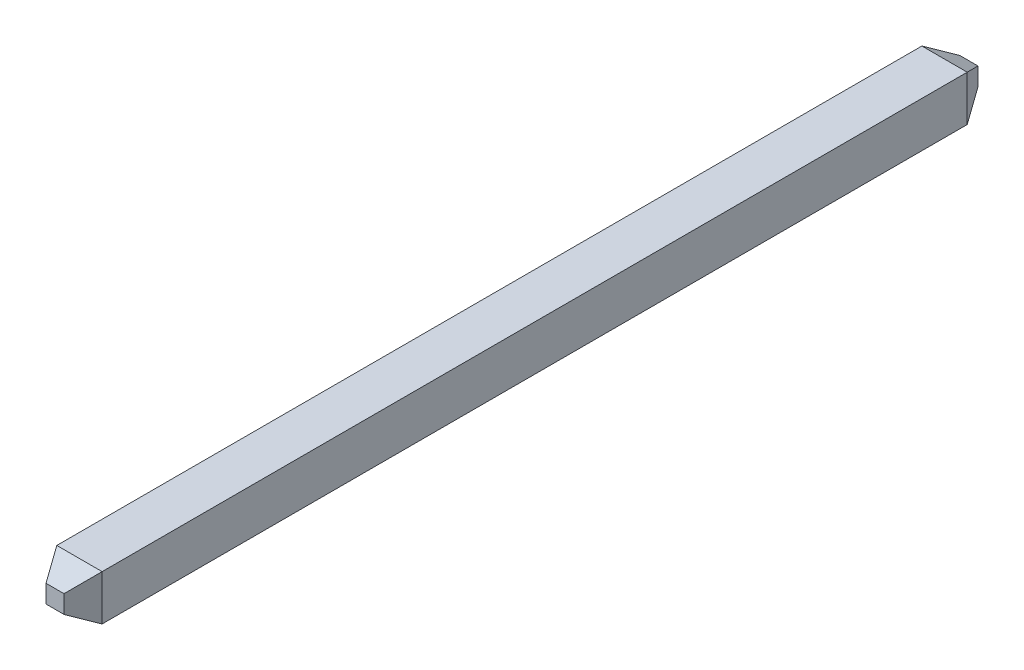
ISO-10303-21;
HEADER;
FILE_DESCRIPTION(('STEP AP214'),'2;1');
FILE_NAME('part.step','',(''),(''),'','','');
FILE_SCHEMA(('AUTOMOTIVE_DESIGN { 1 0 10303 214 1 1 1 1 }'));
ENDSEC;
DATA;
#1=APPLICATION_CONTEXT('core data for automotive mechanical design processes');
#2=APPLICATION_PROTOCOL_DEFINITION('international standard','automotive_design',2000,#1);
#3=PRODUCT_CONTEXT('',#1,'mechanical');
#4=PRODUCT('Part','Part','',(#3));
#5=PRODUCT_RELATED_PRODUCT_CATEGORY('part','',(#4));
#6=PRODUCT_DEFINITION_FORMATION('','',#4);
#7=PRODUCT_DEFINITION_CONTEXT('part definition',#1,'design');
#8=PRODUCT_DEFINITION('design','',#6,#7);
#9=PRODUCT_DEFINITION_SHAPE('','',#8);
#10=(LENGTH_UNIT() NAMED_UNIT(*) SI_UNIT(.MILLI.,.METRE.));
#11=(NAMED_UNIT(*) PLANE_ANGLE_UNIT() SI_UNIT($,.RADIAN.));
#12=(NAMED_UNIT(*) SI_UNIT($,.STERADIAN.) SOLID_ANGLE_UNIT());
#13=UNCERTAINTY_MEASURE_WITH_UNIT(LENGTH_MEASURE(1.E-05),#10,'distance_accuracy_value','');
#14=(GEOMETRIC_REPRESENTATION_CONTEXT(3) GLOBAL_UNCERTAINTY_ASSIGNED_CONTEXT((#13)) GLOBAL_UNIT_ASSIGNED_CONTEXT((#10,
#11,#12)) REPRESENTATION_CONTEXT('',''));
#15=CARTESIAN_POINT('',(0.,0.,0.));
#16=DIRECTION('',(0.,0.,1.));
#17=DIRECTION('',(1.,0.,0.));
#18=AXIS2_PLACEMENT_3D('',#15,#16,#17);
#19=CARTESIAN_POINT('',(0.120115100419239,-1.595,-3.20872569516347));
#20=DIRECTION('',(0.872569516347454,0.,-0.488489958076081));
#21=DIRECTION('',(-0.488489958076081,0.,-0.872569516347454));
#22=AXIS2_PLACEMENT_3D('',#19,#20,#21);
#23=PLANE('',#22);
#24=DIRECTION('',(0.,1.,0.));
#25=VECTOR('',#24,1.);
#26=CARTESIAN_POINT('',(0.315341856644683,-1.595,-2.86000017186176));
#27=LINE('',#26,#25);
#28=CARTESIAN_POINT('',(0.315341856632625,-1.58500002468493,-2.85999984563027));
#29=VERTEX_POINT('',#28);
#30=CARTESIAN_POINT('',(0.315342017291865,-0.954999839641339,-2.8599998849043));
#31=VERTEX_POINT('',#30);
#32=EDGE_CURVE('E144',#29,#31,#27,.T.);
#33=ORIENTED_EDGE('',*,*,#32,.F.);
#34=DIRECTION('',(0.439072617568639,-0.438284036988113,0.784297353956282));
#35=VECTOR('',#34,1.);
#36=CARTESIAN_POINT('',(0.125000000000004,-1.395,-3.2));
#37=LINE('',#36,#35);
#38=CARTESIAN_POINT('',(0.125000000000003,-1.395,-3.2));
#39=VERTEX_POINT('',#38);
#40=EDGE_CURVE('E141',#39,#29,#37,.T.);
#41=ORIENTED_EDGE('',*,*,#40,.F.);
#42=DIRECTION('',(0.,1.,0.));
#43=VECTOR('',#42,1.);
#44=CARTESIAN_POINT('',(0.125000000000004,-1.405,-3.2));
#45=LINE('',#44,#43);
#46=CARTESIAN_POINT('',(0.125000000000003,-1.145,-3.2));
#47=VERTEX_POINT('',#46);
#48=EDGE_CURVE('E93',#47,#39,#45,.F.);
#49=ORIENTED_EDGE('',*,*,#48,.F.);
#50=DIRECTION('',(-0.439072617568639,-0.438284036988113,-0.784297353956283));
#51=VECTOR('',#50,1.);
#52=CARTESIAN_POINT('',(0.315341856644679,-0.955000000000001,-2.86000017186176));
#53=LINE('',#52,#51);
#54=EDGE_CURVE('E133',#31,#47,#53,.T.);
#55=ORIENTED_EDGE('',*,*,#54,.F.);
#56=EDGE_LOOP('',(#33,#41,#49,#55));
#57=FACE_BOUND('',#56,.T.);
#58=ADVANCED_FACE('F16',(#57),#23,.T.);
#59=CARTESIAN_POINT('',(0.12036702814295,-1.595,9.50441734607014));
#60=DIRECTION('',(0.873317045523297,0.,0.487152273933377));
#61=DIRECTION('',(0.487152273933377,0.,-0.873317045523297));
#62=AXIS2_PLACEMENT_3D('',#59,#60,#61);
#63=PLANE('',#62);
#64=DIRECTION('',(-0.437799852400895,0.438586917260846,0.784839349959839));
#65=VECTOR('',#64,1.);
#66=CARTESIAN_POINT('',(0.314897899551643,-1.58500031317147,9.15568378706484));
#67=LINE('',#66,#65);
#68=CARTESIAN_POINT('',(0.314897654549926,-1.58500010892315,9.15568368845102));
#69=VERTEX_POINT('',#68);
#70=CARTESIAN_POINT('',(0.125238550882283,-1.395,9.49568417561491));
#71=VERTEX_POINT('',#70);
#72=EDGE_CURVE('E150',#69,#71,#67,.T.);
#73=ORIENTED_EDGE('',*,*,#72,.F.);
#74=DIRECTION('',(0.,1.,0.));
#75=VECTOR('',#74,1.);
#76=CARTESIAN_POINT('',(0.314898539006426,-1.595,9.15568372243698));
#77=LINE('',#76,#75);
#78=CARTESIAN_POINT('',(0.31489765280461,-0.9549998229674,9.15568371270385));
#79=VERTEX_POINT('',#78);
#80=EDGE_CURVE('E104',#79,#69,#77,.F.);
#81=ORIENTED_EDGE('',*,*,#80,.F.);
#82=DIRECTION('',(0.437799852400897,0.438586917260845,-0.784839349959838));
#83=VECTOR('',#82,1.);
#84=CARTESIAN_POINT('',(0.125238550882283,-1.145,9.49568417561491));
#85=LINE('',#84,#83);
#86=CARTESIAN_POINT('',(0.125238550882283,-1.145,9.49568417561491));
#87=VERTEX_POINT('',#86);
#88=EDGE_CURVE('E99',#87,#79,#85,.T.);
#89=ORIENTED_EDGE('',*,*,#88,.F.);
#90=DIRECTION('',(0.,1.,0.));
#91=VECTOR('',#90,1.);
#92=CARTESIAN_POINT('',(0.125238550882283,-1.135,9.49568417561491));
#93=LINE('',#92,#91);
#94=EDGE_CURVE('E19',#71,#87,#93,.T.);
#95=ORIENTED_EDGE('',*,*,#94,.F.);
#96=EDGE_LOOP('',(#73,#81,#89,#95));
#97=FACE_BOUND('',#96,.T.);
#98=ADVANCED_FACE('F101',(#97),#63,.T.);
#99=CARTESIAN_POINT('',(-0.134761449117717,-1.135,9.49568417561491));
#100=DIRECTION('',(0.,0.,1.));
#101=DIRECTION('',(1.,0.,0.));
#102=AXIS2_PLACEMENT_3D('',#99,#100,#101);
#103=PLANE('',#102);
#104=DIRECTION('',(1.,0.,0.));
#105=VECTOR('',#104,1.);
#106=CARTESIAN_POINT('',(-0.325103305762397,-1.145,9.49568417561491));
#107=LINE('',#106,#105);
#108=CARTESIAN_POINT('',(-0.124761449117718,-1.145,9.49568417561491));
#109=VERTEX_POINT('',#108);
#110=EDGE_CURVE('E109',#109,#87,#107,.T.);
#111=ORIENTED_EDGE('',*,*,#110,.F.);
#112=DIRECTION('',(0.,1.,0.));
#113=VECTOR('',#112,1.);
#114=CARTESIAN_POINT('',(-0.124761449117719,-1.595,9.49568417561491));
#115=LINE('',#114,#113);
#116=CARTESIAN_POINT('',(-0.124761449117718,-1.395,9.49568417561491));
#117=VERTEX_POINT('',#116);
#118=EDGE_CURVE('E160',#117,#109,#115,.T.);
#119=ORIENTED_EDGE('',*,*,#118,.F.);
#120=DIRECTION('',(1.,0.,0.));
#121=VECTOR('',#120,1.);
#122=CARTESIAN_POINT('',(-0.325103305762399,-1.395,9.49568417561491));
#123=LINE('',#122,#121);
#124=EDGE_CURVE('E114',#71,#117,#123,.F.);
#125=ORIENTED_EDGE('',*,*,#124,.F.);
#126=ORIENTED_EDGE('',*,*,#94,.T.);
#127=EDGE_LOOP('',(#111,#119,#125,#126));
#128=FACE_BOUND('',#127,.T.);
#129=ADVANCED_FACE('F111',(#128),#103,.T.);
#130=CARTESIAN_POINT('',(-0.325103305762397,-1.14987821545568,9.50441360938624));
#131=DIRECTION('',(0.,0.872943377132664,0.487821545567864));
#132=DIRECTION('',(0.,-0.487821545567864,0.872943377132664));
#133=AXIS2_PLACEMENT_3D('',#130,#131,#132);
#134=PLANE('',#133);
#135=DIRECTION('',(-0.439072459537934,0.438284700441648,-0.784297071672517));
#136=VECTOR('',#135,1.);
#137=CARTESIAN_POINT('',(-0.124761449117719,-1.145,9.49568417561491));
#138=LINE('',#137,#136);
#139=CARTESIAN_POINT('',(-0.315102496297201,-0.954999917527425,9.15568447138296));
#140=VERTEX_POINT('',#139);
#141=EDGE_CURVE('E119',#109,#140,#138,.T.);
#142=ORIENTED_EDGE('',*,*,#141,.F.);
#143=ORIENTED_EDGE('',*,*,#110,.T.);
#144=ORIENTED_EDGE('',*,*,#88,.T.);
#145=DIRECTION('',(1.,0.,0.));
#146=VECTOR('',#145,1.);
#147=CARTESIAN_POINT('',(6.65893728155065E-05,-0.955,9.15568497320463));
#148=LINE('',#147,#146);
#149=EDGE_CURVE('E162',#140,#79,#148,.T.);
#150=ORIENTED_EDGE('',*,*,#149,.F.);
#151=EDGE_LOOP('',(#142,#143,#144,#150));
#152=FACE_BOUND('',#151,.T.);
#153=ADVANCED_FACE('F117',(#152),#134,.T.);
#154=CARTESIAN_POINT('',(-0.135,-1.405,-3.2));
#155=DIRECTION('',(0.,0.,-1.));
#156=DIRECTION('',(-1.,0.,0.));
#157=AXIS2_PLACEMENT_3D('',#154,#155,#156);
#158=PLANE('',#157);
#159=ORIENTED_EDGE('',*,*,#48,.T.);
#160=DIRECTION('',(1.,0.,0.));
#161=VECTOR('',#160,1.);
#162=CARTESIAN_POINT('',(-0.324658143355321,-1.395,-3.2));
#163=LINE('',#162,#161);
#164=CARTESIAN_POINT('',(-0.124999999999996,-1.395,-3.2));
#165=VERTEX_POINT('',#164);
#166=EDGE_CURVE('E137',#165,#39,#163,.T.);
#167=ORIENTED_EDGE('',*,*,#166,.F.);
#168=DIRECTION('',(0.,1.,0.));
#169=VECTOR('',#168,1.);
#170=CARTESIAN_POINT('',(-0.124999999999998,-1.595,-3.2));
#171=LINE('',#170,#169);
#172=CARTESIAN_POINT('',(-0.124999999999996,-1.145,-3.2));
#173=VERTEX_POINT('',#172);
#174=EDGE_CURVE('E173',#173,#165,#171,.F.);
#175=ORIENTED_EDGE('',*,*,#174,.F.);
#176=DIRECTION('',(1.,0.,0.));
#177=VECTOR('',#176,1.);
#178=CARTESIAN_POINT('',(-0.32465814335532,-1.145,-3.2));
#179=LINE('',#178,#177);
#180=EDGE_CURVE('E127',#47,#173,#179,.F.);
#181=ORIENTED_EDGE('',*,*,#180,.F.);
#182=EDGE_LOOP('',(#159,#167,#175,#181));
#183=FACE_BOUND('',#182,.T.);
#184=ADVANCED_FACE('F226',(#183),#158,.T.);
#185=CARTESIAN_POINT('',(-0.32465814335532,-0.950121784544321,-2.85127073809043));
#186=DIRECTION('',(0.,0.872943377132663,-0.487821545567865));
#187=DIRECTION('',(0.,0.487821545567865,0.872943377132663));
#188=AXIS2_PLACEMENT_3D('',#185,#186,#187);
#189=PLANE('',#188);
#190=DIRECTION('',(1.,0.,0.));
#191=VECTOR('',#190,1.);
#192=CARTESIAN_POINT('',(6.65893728155065E-05,-0.955,-2.86000017186176));
#193=LINE('',#192,#191);
#194=CARTESIAN_POINT('',(-0.314658552313813,-0.954999293190895,-2.8599984305592));
#195=VERTEX_POINT('',#194);
#196=EDGE_CURVE('E169',#31,#195,#193,.F.);
#197=ORIENTED_EDGE('',*,*,#196,.F.);
#198=ORIENTED_EDGE('',*,*,#54,.T.);
#199=ORIENTED_EDGE('',*,*,#180,.T.);
#200=DIRECTION('',(0.437798396819593,-0.438586429089662,-0.784840434713052));
#201=VECTOR('',#200,1.);
#202=CARTESIAN_POINT('',(-0.314659335924682,-0.954999279369218,-2.85999803394471));
#203=LINE('',#202,#201);
#204=EDGE_CURVE('E180',#195,#173,#203,.T.);
#205=ORIENTED_EDGE('',*,*,#204,.F.);
#206=EDGE_LOOP('',(#197,#198,#199,#205));
#207=FACE_BOUND('',#206,.T.);
#208=ADVANCED_FACE('F224',(#207),#189,.T.);
#209=CARTESIAN_POINT('',(-0.324658143355321,-1.39012178454432,-3.20872943377133));
#210=DIRECTION('',(0.,-0.872943377132663,-0.487821545567865));
#211=DIRECTION('',(0.,0.487821545567865,-0.872943377132663));
#212=AXIS2_PLACEMENT_3D('',#209,#210,#211);
#213=PLANE('',#212);
#214=ORIENTED_EDGE('',*,*,#166,.T.);
#215=ORIENTED_EDGE('',*,*,#40,.T.);
#216=DIRECTION('',(1.,0.,0.));
#217=VECTOR('',#216,1.);
#218=CARTESIAN_POINT('',(-0.325051653144535,-1.585,-2.85999756200982));
#219=LINE('',#218,#217);
#220=CARTESIAN_POINT('',(-0.314658017815116,-1.58500027023654,-2.85999898491791));
#221=VERTEX_POINT('',#220);
#222=EDGE_CURVE('E39',#221,#29,#219,.T.);
#223=ORIENTED_EDGE('',*,*,#222,.F.);
#224=DIRECTION('',(-0.437798396819594,-0.438586429089659,0.784840434713054));
#225=VECTOR('',#224,1.);
#226=CARTESIAN_POINT('',(-0.124999999999998,-1.395,-3.2));
#227=LINE('',#226,#225);
#228=EDGE_CURVE('E177',#165,#221,#227,.T.);
#229=ORIENTED_EDGE('',*,*,#228,.F.);
#230=EDGE_LOOP('',(#214,#215,#223,#229));
#231=FACE_BOUND('',#230,.T.);
#232=ADVANCED_FACE('F227',(#231),#213,.T.);
#233=CARTESIAN_POINT('',(0.315346308268754,-1.595,-2.98065701705514));
#234=DIRECTION('',(0.999999999319383,0.,3.68949151671738E-05));
#235=DIRECTION('',(3.68949151671738E-05,0.,-0.999999999319383));
#236=AXIS2_PLACEMENT_3D('',#233,#234,#235);
#237=PLANE('',#236);
#238=DIRECTION('',(3.69481335093583E-05,0.,-0.999999999317418));
#239=VECTOR('',#238,1.);
#240=CARTESIAN_POINT('',(0.314897899551644,-0.955,9.15568372241339));
#241=LINE('',#240,#239);
#242=EDGE_CURVE('E165',#79,#31,#241,.T.);
#243=ORIENTED_EDGE('',*,*,#242,.F.);
#244=ORIENTED_EDGE('',*,*,#80,.T.);
#245=DIRECTION('',(-3.69481335094485E-05,0.,0.999999999317418));
#246=VECTOR('',#245,1.);
#247=CARTESIAN_POINT('',(0.315341856644679,-1.585,-2.86000017186176));
#248=LINE('',#247,#246);
#249=EDGE_CURVE('E186',#29,#69,#248,.T.);
#250=ORIENTED_EDGE('',*,*,#249,.F.);
#251=ORIENTED_EDGE('',*,*,#32,.T.);
#252=EDGE_LOOP('',(#243,#244,#250,#251));
#253=FACE_BOUND('',#252,.T.);
#254=ADVANCED_FACE('F229',(#253),#237,.T.);
#255=CARTESIAN_POINT('',(-0.325103305762399,-1.58987821545568,9.14695491370534));
#256=DIRECTION('',(0.,-0.872943377132664,0.487821545567864));
#257=DIRECTION('',(0.,-0.487821545567864,-0.872943377132664));
#258=AXIS2_PLACEMENT_3D('',#255,#256,#257);
#259=PLANE('',#258);
#260=ORIENTED_EDGE('',*,*,#124,.T.);
#261=DIRECTION('',(0.439072459537934,0.438284700441648,0.784297071672516));
#262=VECTOR('',#261,1.);
#263=CARTESIAN_POINT('',(-0.315102751134454,-1.5849998023649,9.15568533818575));
#264=LINE('',#263,#262);
#265=CARTESIAN_POINT('',(-0.315102182397624,-1.58499988392429,9.15568487573228));
#266=VERTEX_POINT('',#265);
#267=EDGE_CURVE('E156',#266,#117,#264,.T.);
#268=ORIENTED_EDGE('',*,*,#267,.F.);
#269=DIRECTION('',(1.,0.,0.));
#270=VECTOR('',#269,1.);
#271=CARTESIAN_POINT('',(-0.325051653144535,-1.585,9.15568372241339));
#272=LINE('',#271,#270);
#273=EDGE_CURVE('E190',#69,#266,#272,.F.);
#274=ORIENTED_EDGE('',*,*,#273,.F.);
#275=ORIENTED_EDGE('',*,*,#72,.T.);
#276=EDGE_LOOP('',(#260,#268,#274,#275));
#277=FACE_BOUND('',#276,.T.);
#278=ADVANCED_FACE('F216',(#277),#259,.T.);
#279=CARTESIAN_POINT('',(-0.119876549536956,-1.595,9.50440987077839));
#280=DIRECTION('',(-0.872569516347453,0.,0.488489958076082));
#281=DIRECTION('',(0.488489958076082,0.,0.872569516347453));
#282=AXIS2_PLACEMENT_3D('',#279,#280,#281);
#283=PLANE('',#282);
#284=ORIENTED_EDGE('',*,*,#267,.T.);
#285=ORIENTED_EDGE('',*,*,#118,.T.);
#286=ORIENTED_EDGE('',*,*,#141,.T.);
#287=DIRECTION('',(0.,1.,0.));
#288=VECTOR('',#287,1.);
#289=CARTESIAN_POINT('',(-0.315101461039725,-1.595,9.15568497322818));
#290=LINE('',#289,#288);
#291=EDGE_CURVE('E194',#266,#140,#290,.T.);
#292=ORIENTED_EDGE('',*,*,#291,.F.);
#293=EDGE_LOOP('',(#284,#285,#286,#292));
#294=FACE_BOUND('',#293,.T.);
#295=ADVANCED_FACE('F219',(#294),#283,.T.);
#296=CARTESIAN_POINT('',(6.65893728155065E-05,-0.955,9.32634470275115));
#297=DIRECTION('',(0.,1.,0.));
#298=DIRECTION('',(0.,0.,1.));
#299=AXIS2_PLACEMENT_3D('',#296,#297,#298);
#300=PLANE('',#299);
#301=ORIENTED_EDGE('',*,*,#196,.T.);
#302=DIRECTION('',(-3.68949151674615E-05,0.,0.999999999319383));
#303=VECTOR('',#302,1.);
#304=CARTESIAN_POINT('',(-0.31510775764562,-0.955000197635096,9.32634821671993));
#305=LINE('',#304,#303);
#306=EDGE_CURVE('E198',#140,#195,#305,.F.);
#307=ORIENTED_EDGE('',*,*,#306,.F.);
#308=ORIENTED_EDGE('',*,*,#149,.T.);
#309=ORIENTED_EDGE('',*,*,#242,.T.);
#310=EDGE_LOOP('',(#301,#307,#308,#309));
#311=FACE_BOUND('',#310,.T.);
#312=ADVANCED_FACE('F221',(#311),#300,.T.);
#313=CARTESIAN_POINT('',(-0.120128477260666,-1.595,-3.20873317045523));
#314=DIRECTION('',(-0.873317045523297,0.,-0.487152273933376));
#315=DIRECTION('',(-0.487152273933376,0.,0.873317045523297));
#316=AXIS2_PLACEMENT_3D('',#313,#314,#315);
#317=PLANE('',#316);
#318=DIRECTION('',(0.,1.,0.));
#319=VECTOR('',#318,1.);
#320=CARTESIAN_POINT('',(-0.314658143451607,-1.595,-2.85999756199704));
#321=LINE('',#320,#319);
#322=EDGE_CURVE('E26',#195,#221,#321,.F.);
#323=ORIENTED_EDGE('',*,*,#322,.F.);
#324=ORIENTED_EDGE('',*,*,#204,.T.);
#325=ORIENTED_EDGE('',*,*,#174,.T.);
#326=ORIENTED_EDGE('',*,*,#228,.T.);
#327=EDGE_LOOP('',(#323,#324,#325,#326));
#328=FACE_BOUND('',#327,.T.);
#329=ADVANCED_FACE('F210',(#328),#317,.T.);
#330=CARTESIAN_POINT('',(-0.325051653144535,-1.585,3.17284922525592));
#331=DIRECTION('',(0.,-1.,0.));
#332=DIRECTION('',(0.,0.,-1.));
#333=AXIS2_PLACEMENT_3D('',#330,#331,#332);
#334=PLANE('',#333);
#335=ORIENTED_EDGE('',*,*,#249,.T.);
#336=ORIENTED_EDGE('',*,*,#273,.T.);
#337=DIRECTION('',(-3.68949151674615E-05,0.,0.999999999319383));
#338=VECTOR('',#337,1.);
#339=CARTESIAN_POINT('',(-0.31510775764562,-1.58500072063078,9.32634821671993));
#340=LINE('',#339,#338);
#341=EDGE_CURVE('E11',#221,#266,#340,.T.);
#342=ORIENTED_EDGE('',*,*,#341,.F.);
#343=ORIENTED_EDGE('',*,*,#222,.T.);
#344=EDGE_LOOP('',(#335,#336,#342,#343));
#345=FACE_BOUND('',#344,.T.);
#346=ADVANCED_FACE('F212',(#345),#334,.T.);
#347=CARTESIAN_POINT('',(-0.31510775764562,-1.595,9.32634821671993));
#348=DIRECTION('',(-0.999999999319383,0.,-3.68949151674615E-05));
#349=DIRECTION('',(-3.68949151674615E-05,0.,0.999999999319383));
#350=AXIS2_PLACEMENT_3D('',#347,#348,#349);
#351=PLANE('',#350);
#352=ORIENTED_EDGE('',*,*,#322,.T.);
#353=ORIENTED_EDGE('',*,*,#341,.T.);
#354=ORIENTED_EDGE('',*,*,#291,.T.);
#355=ORIENTED_EDGE('',*,*,#306,.T.);
#356=EDGE_LOOP('',(#352,#353,#354,#355));
#357=FACE_BOUND('',#356,.T.);
#358=ADVANCED_FACE('F206',(#357),#351,.T.);
#359=CLOSED_SHELL('',(#58,#98,#129,#153,#184,#208,#232,#254,#278,#295,#312,#329,#346,#358));
#360=MANIFOLD_SOLID_BREP('B1',#359);
#361=ADVANCED_BREP_SHAPE_REPRESENTATION('',(#18,#360),#14);
#362=SHAPE_DEFINITION_REPRESENTATION(#9,#361);
ENDSEC;
END-ISO-10303-21;
